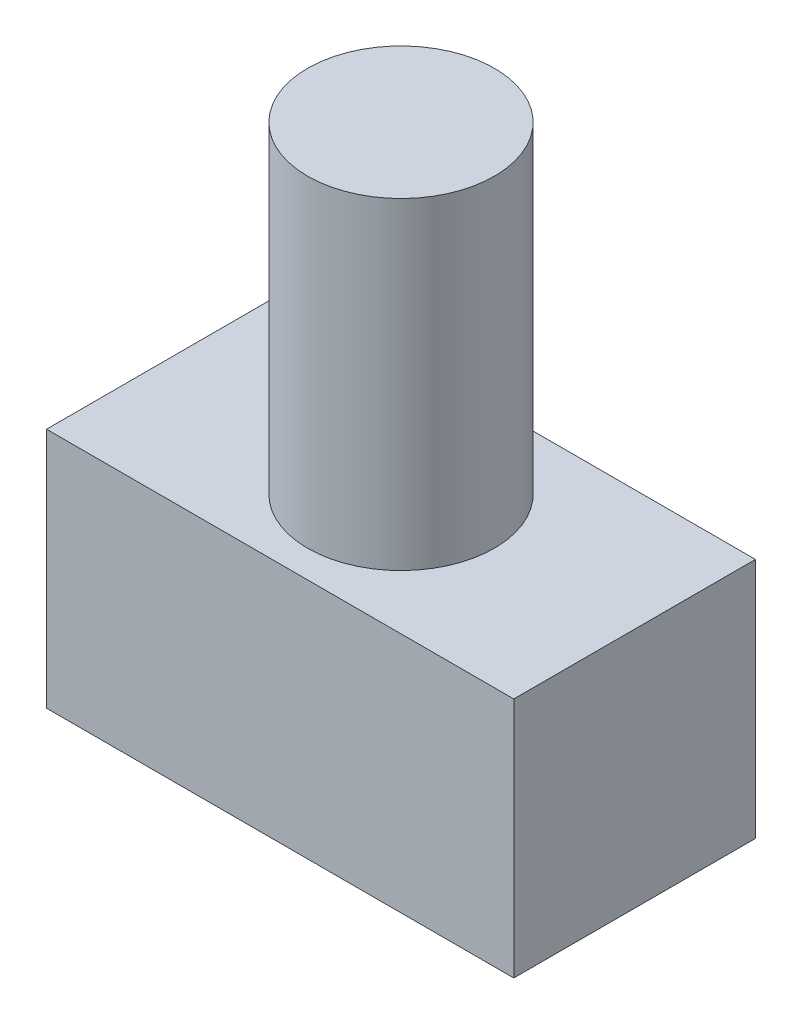
ISO-10303-21;
HEADER;
FILE_DESCRIPTION(('STEP AP214'),'2;1');
FILE_NAME('part.step','',(''),(''),'','','');
FILE_SCHEMA(('AUTOMOTIVE_DESIGN { 1 0 10303 214 1 1 1 1 }'));
ENDSEC;
DATA;
#1=APPLICATION_CONTEXT('core data for automotive mechanical design processes');
#2=APPLICATION_PROTOCOL_DEFINITION('international standard','automotive_design',2000,#1);
#3=PRODUCT_CONTEXT('',#1,'mechanical');
#4=PRODUCT('Part','Part','',(#3));
#5=PRODUCT_RELATED_PRODUCT_CATEGORY('part','',(#4));
#6=PRODUCT_DEFINITION_FORMATION('','',#4);
#7=PRODUCT_DEFINITION_CONTEXT('part definition',#1,'design');
#8=PRODUCT_DEFINITION('design','',#6,#7);
#9=PRODUCT_DEFINITION_SHAPE('','',#8);
#10=(LENGTH_UNIT() NAMED_UNIT(*) SI_UNIT(.MILLI.,.METRE.));
#11=(NAMED_UNIT(*) PLANE_ANGLE_UNIT() SI_UNIT($,.RADIAN.));
#12=(NAMED_UNIT(*) SI_UNIT($,.STERADIAN.) SOLID_ANGLE_UNIT());
#13=UNCERTAINTY_MEASURE_WITH_UNIT(LENGTH_MEASURE(1.E-05),#10,'distance_accuracy_value','');
#14=(GEOMETRIC_REPRESENTATION_CONTEXT(3) GLOBAL_UNCERTAINTY_ASSIGNED_CONTEXT((#13)) GLOBAL_UNIT_ASSIGNED_CONTEXT((#10,
#11,#12)) REPRESENTATION_CONTEXT('',''));
#15=CARTESIAN_POINT('',(0.,0.,0.));
#16=DIRECTION('',(0.,0.,1.));
#17=DIRECTION('',(1.,0.,0.));
#18=AXIS2_PLACEMENT_3D('',#15,#16,#17);
#19=CARTESIAN_POINT('',(14.5,7.5,15.));
#20=DIRECTION('',(-1.,0.,0.));
#21=DIRECTION('',(0.,-1.,0.));
#22=AXIS2_PLACEMENT_3D('',#19,#20,#21);
#23=PLANE('',#22);
#24=DIRECTION('',(0.,1.,0.));
#25=VECTOR('',#24,1.);
#26=CARTESIAN_POINT('',(14.5,7.5,0.));
#27=LINE('',#26,#25);
#28=CARTESIAN_POINT('',(14.5,-7.5,0.));
#29=VERTEX_POINT('',#28);
#30=CARTESIAN_POINT('',(14.5,7.5,0.));
#31=VERTEX_POINT('',#30);
#32=EDGE_CURVE('E110',#29,#31,#27,.T.);
#33=ORIENTED_EDGE('',*,*,#32,.T.);
#34=DIRECTION('',(0.,0.,-1.));
#35=VECTOR('',#34,1.);
#36=CARTESIAN_POINT('',(14.5,7.5,15.));
#37=LINE('',#36,#35);
#38=CARTESIAN_POINT('',(14.5,7.5,15.));
#39=VERTEX_POINT('',#38);
#40=EDGE_CURVE('E42',#39,#31,#37,.T.);
#41=ORIENTED_EDGE('',*,*,#40,.F.);
#42=DIRECTION('',(0.,1.,0.));
#43=VECTOR('',#42,1.);
#44=CARTESIAN_POINT('',(14.5,7.5,15.));
#45=LINE('',#44,#43);
#46=CARTESIAN_POINT('',(14.5,-7.5,15.));
#47=VERTEX_POINT('',#46);
#48=EDGE_CURVE('E93',#47,#39,#45,.T.);
#49=ORIENTED_EDGE('',*,*,#48,.F.);
#50=DIRECTION('',(0.,0.,-1.));
#51=VECTOR('',#50,1.);
#52=CARTESIAN_POINT('',(14.5,-7.5,15.));
#53=LINE('',#52,#51);
#54=EDGE_CURVE('E106',#47,#29,#53,.T.);
#55=ORIENTED_EDGE('',*,*,#54,.T.);
#56=EDGE_LOOP('',(#33,#41,#49,#55));
#57=FACE_BOUND('',#56,.T.);
#58=ADVANCED_FACE('F39',(#57),#23,.F.);
#59=CARTESIAN_POINT('',(-14.5,7.5,15.));
#60=DIRECTION('',(0.,-1.,0.));
#61=DIRECTION('',(0.,0.,-1.));
#62=AXIS2_PLACEMENT_3D('',#59,#60,#61);
#63=PLANE('',#62);
#64=CARTESIAN_POINT('',(0.,7.5,7.5));
#65=DIRECTION('',(0.,1.,0.));
#66=DIRECTION('',(0.,0.,1.));
#67=AXIS2_PLACEMENT_3D('',#64,#65,#66);
#68=CIRCLE('',#67,5.8);
#69=CARTESIAN_POINT('',(0.,7.5,13.3));
#70=VERTEX_POINT('',#69);
#71=EDGE_CURVE('E11',#70,#70,#68,.T.);
#72=ORIENTED_EDGE('',*,*,#71,.F.);
#73=EDGE_LOOP('',(#72));
#74=FACE_BOUND('',#73,.T.);
#75=DIRECTION('',(-1.,0.,0.));
#76=VECTOR('',#75,1.);
#77=CARTESIAN_POINT('',(-14.5,7.5,0.));
#78=LINE('',#77,#76);
#79=CARTESIAN_POINT('',(-14.5,7.5,0.));
#80=VERTEX_POINT('',#79);
#81=EDGE_CURVE('E99',#31,#80,#78,.T.);
#82=ORIENTED_EDGE('',*,*,#81,.T.);
#83=DIRECTION('',(0.,0.,-1.));
#84=VECTOR('',#83,1.);
#85=CARTESIAN_POINT('',(-14.5,7.5,15.));
#86=LINE('',#85,#84);
#87=CARTESIAN_POINT('',(-14.5,7.5,15.));
#88=VERTEX_POINT('',#87);
#89=EDGE_CURVE('E97',#88,#80,#86,.T.);
#90=ORIENTED_EDGE('',*,*,#89,.F.);
#91=DIRECTION('',(-1.,0.,0.));
#92=VECTOR('',#91,1.);
#93=CARTESIAN_POINT('',(-14.5,7.5,15.));
#94=LINE('',#93,#92);
#95=EDGE_CURVE('E88',#39,#88,#94,.T.);
#96=ORIENTED_EDGE('',*,*,#95,.F.);
#97=ORIENTED_EDGE('',*,*,#40,.T.);
#98=EDGE_LOOP('',(#82,#90,#96,#97));
#99=FACE_BOUND('',#98,.T.);
#100=ADVANCED_FACE('F98',(#74,#99),#63,.F.);
#101=CARTESIAN_POINT('',(-14.5,7.5,15.));
#102=DIRECTION('',(1.,0.,0.));
#103=DIRECTION('',(0.,1.,0.));
#104=AXIS2_PLACEMENT_3D('',#101,#102,#103);
#105=PLANE('',#104);
#106=DIRECTION('',(0.,-1.,0.));
#107=VECTOR('',#106,1.);
#108=CARTESIAN_POINT('',(-14.5,7.5,0.));
#109=LINE('',#108,#107);
#110=CARTESIAN_POINT('',(-14.5,-7.5,0.));
#111=VERTEX_POINT('',#110);
#112=EDGE_CURVE('E74',#80,#111,#109,.T.);
#113=ORIENTED_EDGE('',*,*,#112,.T.);
#114=DIRECTION('',(0.,0.,-1.));
#115=VECTOR('',#114,1.);
#116=CARTESIAN_POINT('',(-14.5,-7.5,15.));
#117=LINE('',#116,#115);
#118=CARTESIAN_POINT('',(-14.5,-7.5,15.));
#119=VERTEX_POINT('',#118);
#120=EDGE_CURVE('E101',#119,#111,#117,.T.);
#121=ORIENTED_EDGE('',*,*,#120,.F.);
#122=DIRECTION('',(0.,-1.,0.));
#123=VECTOR('',#122,1.);
#124=CARTESIAN_POINT('',(-14.5,7.5,15.));
#125=LINE('',#124,#123);
#126=EDGE_CURVE('E91',#88,#119,#125,.T.);
#127=ORIENTED_EDGE('',*,*,#126,.F.);
#128=ORIENTED_EDGE('',*,*,#89,.T.);
#129=EDGE_LOOP('',(#113,#121,#127,#128));
#130=FACE_BOUND('',#129,.T.);
#131=ADVANCED_FACE('F102',(#130),#105,.F.);
#132=CARTESIAN_POINT('',(-14.5,-7.5,15.));
#133=DIRECTION('',(0.,1.,0.));
#134=DIRECTION('',(0.,0.,1.));
#135=AXIS2_PLACEMENT_3D('',#132,#133,#134);
#136=PLANE('',#135);
#137=DIRECTION('',(1.,0.,0.));
#138=VECTOR('',#137,1.);
#139=CARTESIAN_POINT('',(-14.5,-7.5,0.));
#140=LINE('',#139,#138);
#141=EDGE_CURVE('E80',#111,#29,#140,.T.);
#142=ORIENTED_EDGE('',*,*,#141,.T.);
#143=ORIENTED_EDGE('',*,*,#54,.F.);
#144=DIRECTION('',(1.,0.,0.));
#145=VECTOR('',#144,1.);
#146=CARTESIAN_POINT('',(-14.5,-7.5,15.));
#147=LINE('',#146,#145);
#148=EDGE_CURVE('E57',#119,#47,#147,.T.);
#149=ORIENTED_EDGE('',*,*,#148,.F.);
#150=ORIENTED_EDGE('',*,*,#120,.T.);
#151=EDGE_LOOP('',(#142,#143,#149,#150));
#152=FACE_BOUND('',#151,.T.);
#153=ADVANCED_FACE('F124',(#152),#136,.F.);
#154=CARTESIAN_POINT('',(0.,0.,15.));
#155=DIRECTION('',(0.,0.,1.));
#156=DIRECTION('',(1.,0.,0.));
#157=AXIS2_PLACEMENT_3D('',#154,#155,#156);
#158=PLANE('',#157);
#159=ORIENTED_EDGE('',*,*,#48,.T.);
#160=ORIENTED_EDGE('',*,*,#95,.T.);
#161=ORIENTED_EDGE('',*,*,#126,.T.);
#162=ORIENTED_EDGE('',*,*,#148,.T.);
#163=EDGE_LOOP('',(#159,#160,#161,#162));
#164=FACE_BOUND('',#163,.T.);
#165=ADVANCED_FACE('F89',(#164),#158,.T.);
#166=CARTESIAN_POINT('',(0.,0.,0.));
#167=DIRECTION('',(0.,0.,1.));
#168=DIRECTION('',(1.,0.,0.));
#169=AXIS2_PLACEMENT_3D('',#166,#167,#168);
#170=PLANE('',#169);
#171=CARTESIAN_POINT('',(0.,0.,0.));
#172=DIRECTION('',(0.,0.,-1.));
#173=DIRECTION('',(-1.,0.,0.));
#174=AXIS2_PLACEMENT_3D('',#171,#172,#173);
#175=CIRCLE('',#174,2.5);
#176=CARTESIAN_POINT('',(-2.5,0.,0.));
#177=VERTEX_POINT('',#176);
#178=EDGE_CURVE('E135',#177,#177,#175,.T.);
#179=ORIENTED_EDGE('',*,*,#178,.F.);
#180=EDGE_LOOP('',(#179));
#181=FACE_BOUND('',#180,.T.);
#182=ORIENTED_EDGE('',*,*,#32,.F.);
#183=ORIENTED_EDGE('',*,*,#141,.F.);
#184=ORIENTED_EDGE('',*,*,#112,.F.);
#185=ORIENTED_EDGE('',*,*,#81,.F.);
#186=EDGE_LOOP('',(#182,#183,#184,#185));
#187=FACE_BOUND('',#186,.T.);
#188=ADVANCED_FACE('F127',(#181,#187),#170,.F.);
#189=CARTESIAN_POINT('',(0.,27.5,7.5));
#190=DIRECTION('',(0.,-1.,0.));
#191=DIRECTION('',(0.,0.,-1.));
#192=AXIS2_PLACEMENT_3D('',#189,#190,#191);
#193=CYLINDRICAL_SURFACE('',#192,5.8);
#194=CARTESIAN_POINT('',(0.,27.5,7.5));
#195=DIRECTION('',(0.,1.,0.));
#196=DIRECTION('',(0.,0.,1.));
#197=AXIS2_PLACEMENT_3D('',#194,#195,#196);
#198=CIRCLE('',#197,5.8);
#199=CARTESIAN_POINT('',(0.,27.5,13.3));
#200=VERTEX_POINT('',#199);
#201=EDGE_CURVE('E114',#200,#200,#198,.T.);
#202=ORIENTED_EDGE('',*,*,#201,.F.);
#203=EDGE_LOOP('',(#202));
#204=FACE_BOUND('',#203,.T.);
#205=ORIENTED_EDGE('',*,*,#71,.T.);
#206=EDGE_LOOP('',(#205));
#207=FACE_BOUND('',#206,.T.);
#208=ADVANCED_FACE('F153',(#204,#207),#193,.T.);
#209=CARTESIAN_POINT('',(0.,27.5,7.5));
#210=DIRECTION('',(0.,1.,0.));
#211=DIRECTION('',(0.,0.,1.));
#212=AXIS2_PLACEMENT_3D('',#209,#210,#211);
#213=PLANE('',#212);
#214=ORIENTED_EDGE('',*,*,#201,.T.);
#215=EDGE_LOOP('',(#214));
#216=FACE_BOUND('',#215,.T.);
#217=ADVANCED_FACE('F148',(#216),#213,.T.);
#218=CARTESIAN_POINT('',(0.,0.,8.));
#219=DIRECTION('',(0.,0.,-1.));
#220=DIRECTION('',(-1.,0.,0.));
#221=AXIS2_PLACEMENT_3D('',#218,#219,#220);
#222=CYLINDRICAL_SURFACE('',#221,2.5);
#223=CARTESIAN_POINT('',(0.,0.,8.));
#224=DIRECTION('',(0.,0.,-1.));
#225=DIRECTION('',(-1.,0.,0.));
#226=AXIS2_PLACEMENT_3D('',#223,#224,#225);
#227=CIRCLE('',#226,2.5);
#228=CARTESIAN_POINT('',(-2.5,0.,8.));
#229=VERTEX_POINT('',#228);
#230=EDGE_CURVE('E134',#229,#229,#227,.T.);
#231=ORIENTED_EDGE('',*,*,#230,.F.);
#232=EDGE_LOOP('',(#231));
#233=FACE_BOUND('',#232,.T.);
#234=ORIENTED_EDGE('',*,*,#178,.T.);
#235=EDGE_LOOP('',(#234));
#236=FACE_BOUND('',#235,.T.);
#237=ADVANCED_FACE('F145',(#233,#236),#222,.F.);
#238=CARTESIAN_POINT('',(0.,0.,8.));
#239=DIRECTION('',(0.,0.,-1.));
#240=DIRECTION('',(-1.,0.,0.));
#241=AXIS2_PLACEMENT_3D('',#238,#239,#240);
#242=PLANE('',#241);
#243=ORIENTED_EDGE('',*,*,#230,.T.);
#244=EDGE_LOOP('',(#243));
#245=FACE_BOUND('',#244,.T.);
#246=ADVANCED_FACE('F143',(#245),#242,.T.);
#247=CLOSED_SHELL('',(#58,#100,#131,#153,#165,#188,#208,#217,#237,#246));
#248=MANIFOLD_SOLID_BREP('B2',#247);
#249=ADVANCED_BREP_SHAPE_REPRESENTATION('',(#18,#248),#14);
#250=SHAPE_DEFINITION_REPRESENTATION(#9,#249);
ENDSEC;
END-ISO-10303-21;
